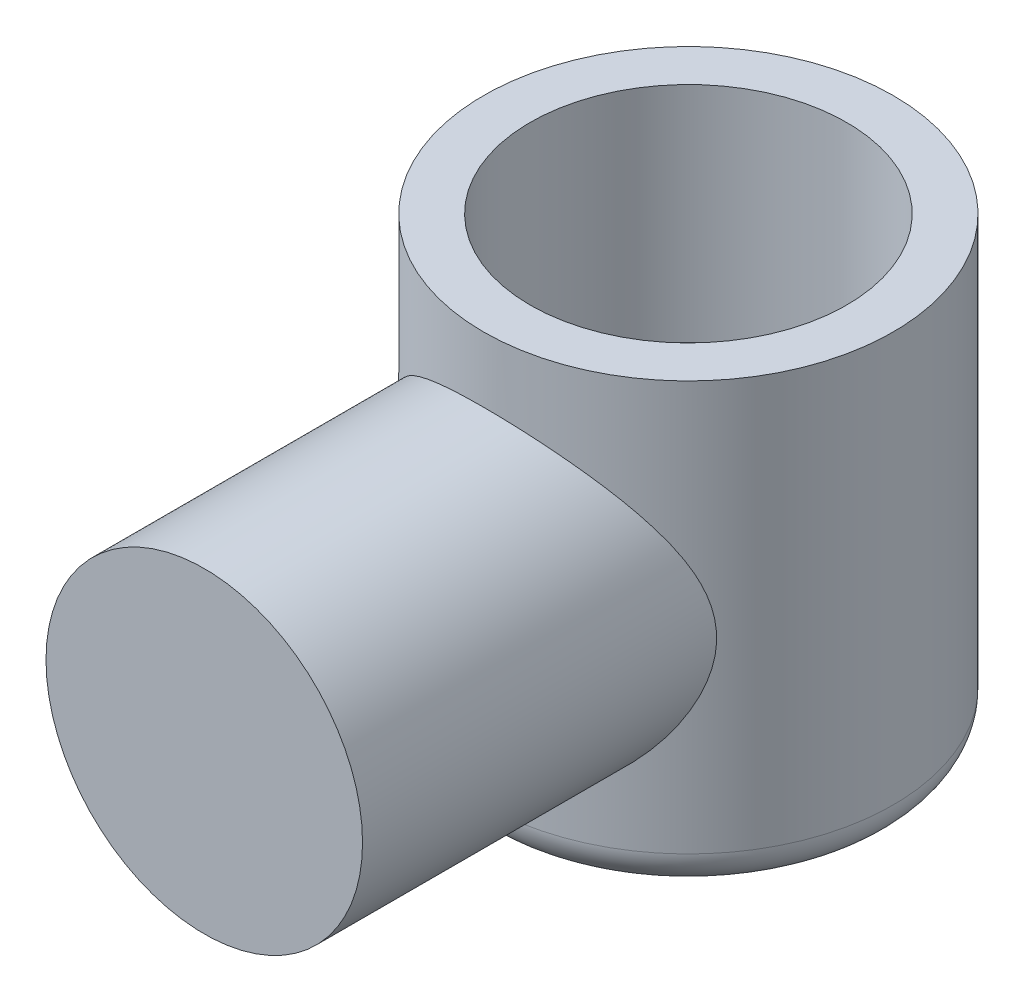
ISO-10303-21;
HEADER;
FILE_DESCRIPTION(('STEP AP214'),'2;1');
FILE_NAME('part.step','',(''),(''),'','','');
FILE_SCHEMA(('AUTOMOTIVE_DESIGN { 1 0 10303 214 1 1 1 1 }'));
ENDSEC;
DATA;
#1=APPLICATION_CONTEXT('core data for automotive mechanical design processes');
#2=APPLICATION_PROTOCOL_DEFINITION('international standard','automotive_design',2000,#1);
#3=PRODUCT_CONTEXT('',#1,'mechanical');
#4=PRODUCT('Part','Part','',(#3));
#5=PRODUCT_RELATED_PRODUCT_CATEGORY('part','',(#4));
#6=PRODUCT_DEFINITION_FORMATION('','',#4);
#7=PRODUCT_DEFINITION_CONTEXT('part definition',#1,'design');
#8=PRODUCT_DEFINITION('design','',#6,#7);
#9=PRODUCT_DEFINITION_SHAPE('','',#8);
#10=(LENGTH_UNIT() NAMED_UNIT(*) SI_UNIT(.MILLI.,.METRE.));
#11=(NAMED_UNIT(*) PLANE_ANGLE_UNIT() SI_UNIT($,.RADIAN.));
#12=(NAMED_UNIT(*) SI_UNIT($,.STERADIAN.) SOLID_ANGLE_UNIT());
#13=UNCERTAINTY_MEASURE_WITH_UNIT(LENGTH_MEASURE(1.E-05),#10,'distance_accuracy_value','');
#14=(GEOMETRIC_REPRESENTATION_CONTEXT(3) GLOBAL_UNCERTAINTY_ASSIGNED_CONTEXT((#13)) GLOBAL_UNIT_ASSIGNED_CONTEXT((#10,
#11,#12)) REPRESENTATION_CONTEXT('',''));
#15=CARTESIAN_POINT('',(0.,0.,0.));
#16=DIRECTION('',(0.,0.,1.));
#17=DIRECTION('',(1.,0.,0.));
#18=AXIS2_PLACEMENT_3D('',#15,#16,#17);
#19=CARTESIAN_POINT('',(0.,60.,0.));
#20=DIRECTION('',(0.,-1.,0.));
#21=DIRECTION('',(0.,0.,-1.));
#22=AXIS2_PLACEMENT_3D('',#19,#20,#21);
#23=CYLINDRICAL_SURFACE('',#22,55.);
#24=CARTESIAN_POINT('',(0.,-50.,0.));
#25=DIRECTION('',(0.,1.,0.));
#26=DIRECTION('',(0.,0.,1.));
#27=AXIS2_PLACEMENT_3D('',#24,#25,#26);
#28=CIRCLE('',#27,55.);
#29=CARTESIAN_POINT('',(0.,-50.,55.));
#30=VERTEX_POINT('',#29);
#31=EDGE_CURVE('E48',#30,#30,#28,.T.);
#32=ORIENTED_EDGE('',*,*,#31,.T.);
#33=EDGE_LOOP('',(#32));
#34=FACE_BOUND('',#33,.T.);
#35=CARTESIAN_POINT('',(0.,60.,0.));
#36=DIRECTION('',(0.,1.,0.));
#37=DIRECTION('',(0.,0.,1.));
#38=AXIS2_PLACEMENT_3D('',#35,#36,#37);
#39=CIRCLE('',#38,55.);
#40=CARTESIAN_POINT('',(0.,60.,55.));
#41=VERTEX_POINT('',#40);
#42=EDGE_CURVE('E63',#41,#41,#39,.T.);
#43=ORIENTED_EDGE('',*,*,#42,.F.);
#44=EDGE_LOOP('',(#43));
#45=FACE_BOUND('',#44,.T.);
#46=CARTESIAN_POINT('',(-42.5,0.,34.9106001094223));
#47=CARTESIAN_POINT('',(-42.5000002288912,-0.489144984326431,34.9105997851785));
#48=CARTESIAN_POINT('',(-42.4915493792357,-0.97829393035291,34.9208955316221));
#49=CARTESIAN_POINT('',(-42.457817106543,-1.95515688155256,34.9619001599965));
#50=CARTESIAN_POINT('',(-42.4325352422677,-2.44287084876996,34.9926095770876));
#51=CARTESIAN_POINT('',(-42.3653387466732,-3.4155049460207,35.0739342720024));
#52=CARTESIAN_POINT('',(-42.3234234950536,-3.9004249711767,35.1245502921923));
#53=CARTESIAN_POINT('',(-42.2232851714191,-4.86621941100944,35.2448610571616));
#54=CARTESIAN_POINT('',(-42.1650596238841,-5.34709320014168,35.3145586980467));
#55=CARTESIAN_POINT('',(-41.9660754884727,-6.78497820199616,35.5512536730363));
#56=CARTESIAN_POINT('',(-41.8012124811986,-7.73435800642852,35.7456011158555));
#57=CARTESIAN_POINT('',(-41.4113987075601,-9.60523078809301,36.1964682107257));
#58=CARTESIAN_POINT('',(-41.1864383853928,-10.526719304493,36.4529977494698));
#59=CARTESIAN_POINT('',(-40.625839626523,-12.5339047626655,37.077660706149));
#60=CARTESIAN_POINT('',(-40.2767899053382,-13.6120680336423,37.4579319519364));
#61=CARTESIAN_POINT('',(-39.502312406044,-15.7187150287624,38.2737974254088));
#62=CARTESIAN_POINT('',(-39.0768618191511,-16.7471838003834,38.7094081628024));
#63=CARTESIAN_POINT('',(-38.1541475858732,-18.7545230170705,39.6192021057817));
#64=CARTESIAN_POINT('',(-37.6568262209241,-19.7333527358697,40.0934161782856));
#65=CARTESIAN_POINT('',(-36.5940886947428,-21.6405718331285,41.0656968927172));
#66=CARTESIAN_POINT('',(-36.0286789558901,-22.5689659569154,41.5637612823181));
#67=CARTESIAN_POINT('',(-34.8161911063449,-24.3991636008042,42.5849452621606));
#68=CARTESIAN_POINT('',(-34.1673571583866,-25.2996270102166,43.1083793188185));
#69=CARTESIAN_POINT('',(-32.8017071071619,-27.0467618949143,44.1564155957314));
#70=CARTESIAN_POINT('',(-32.0848884748354,-27.8934313670834,44.6810178587349));
#71=CARTESIAN_POINT('',(-30.5847654803963,-29.5305572948476,45.7209427029055));
#72=CARTESIAN_POINT('',(-29.8015066541491,-30.3210515789884,46.2362713509327));
#73=CARTESIAN_POINT('',(-28.1689583325873,-31.8434494585851,47.2486214887345));
#74=CARTESIAN_POINT('',(-27.3196727402466,-32.575356512066,47.7456440580623));
#75=CARTESIAN_POINT('',(-25.5947411738821,-33.945822343589,48.6912095230291));
#76=CARTESIAN_POINT('',(-24.72187161527,-34.5870634828419,49.1409219510165));
#77=CARTESIAN_POINT('',(-22.9182735623926,-35.8076562583811,50.007535260636));
#78=CARTESIAN_POINT('',(-21.9875441987151,-36.3870069643344,50.4244356490151));
#79=CARTESIAN_POINT('',(-20.0714287908287,-37.4780239485196,51.217301799851));
#80=CARTESIAN_POINT('',(-19.0860806014535,-37.9897362927696,51.5932953912362));
#81=CARTESIAN_POINT('',(-17.0640681321183,-38.9398857441942,52.2968713559347));
#82=CARTESIAN_POINT('',(-16.0274125252987,-39.3783351814569,52.6244618743697));
#83=CARTESIAN_POINT('',(-14.0689559091465,-40.1152994850695,53.1783562571218));
#84=CARTESIAN_POINT('',(-13.1535489443157,-40.4249510711338,53.4124861195881));
#85=CARTESIAN_POINT('',(-11.2942726185532,-40.9833041668282,53.8363088428573));
#86=CARTESIAN_POINT('',(-10.3504059701077,-41.2320114645527,54.026005923523));
#87=CARTESIAN_POINT('',(-8.44015207584701,-41.665002526401,54.3571797125297));
#88=CARTESIAN_POINT('',(-7.47377617658784,-41.8493180305475,54.4986801770982));
#89=CARTESIAN_POINT('',(-5.5245108686448,-42.1509470517049,54.730640675359));
#90=CARTESIAN_POINT('',(-4.54162127314463,-42.2682598102003,54.8211001312332));
#91=CARTESIAN_POINT('',(-2.5636885701714,-42.4342465292041,54.9491808198944));
#92=CARTESIAN_POINT('',(-1.56861822921809,-42.4827177009214,54.9866459443309));
#93=CARTESIAN_POINT('',(0.423039341332994,-42.5095622367977,55.0073886621494));
#94=CARTESIAN_POINT('',(1.41962657400649,-42.4879354586325,54.9906661455108));
#95=CARTESIAN_POINT('',(3.40656238673648,-42.3749415857676,54.9034096745232));
#96=CARTESIAN_POINT('',(4.396910224597,-42.2835663464949,54.8328694358445));
#97=CARTESIAN_POINT('',(6.36370590413459,-42.03255987222,54.6395432558043));
#98=CARTESIAN_POINT('',(7.34015394373414,-41.8729296101235,54.5167580591416));
#99=CARTESIAN_POINT('',(9.2301000257284,-41.4963003951078,54.2280279248772));
#100=CARTESIAN_POINT('',(10.1444857875692,-41.2821084508025,54.0641998867619));
#101=CARTESIAN_POINT('',(11.9490403604779,-40.7963668173438,53.6942155727445));
#102=CARTESIAN_POINT('',(12.8392100607105,-40.5248192373904,53.4880608533747));
#103=CARTESIAN_POINT('',(14.5911042584072,-39.9275135843936,53.0369496202634));
#104=CARTESIAN_POINT('',(15.4528257553072,-39.60174981467,52.791989029187));
#105=CARTESIAN_POINT('',(17.1442933501702,-38.899382827112,52.2671744266677));
#106=CARTESIAN_POINT('',(17.9740375393873,-38.522776580481,51.9873183365002));
#107=CARTESIAN_POINT('',(19.6837958371438,-37.6802190386756,51.3659386528833));
#108=CARTESIAN_POINT('',(20.5600030565746,-37.2090438996185,51.0210269275216));
#109=CARTESIAN_POINT('',(22.2675406540159,-36.2130338409742,50.299264721007));
#110=CARTESIAN_POINT('',(23.0988684038329,-35.6881957840218,49.9224123726884));
#111=CARTESIAN_POINT('',(24.7153332647529,-34.5884156820301,49.1422236946961));
#112=CARTESIAN_POINT('',(25.5004441782203,-34.0134456696103,48.7388726133643));
#113=CARTESIAN_POINT('',(27.0228293792587,-32.8169795483925,47.9115579848606));
#114=CARTESIAN_POINT('',(27.7601014001569,-32.19548123802,47.487593462658));
#115=CARTESIAN_POINT('',(29.3304821825735,-30.7783477350251,46.5373693848213));
#116=CARTESIAN_POINT('',(30.1527706068329,-29.9729330412174,46.0077784030319));
#117=CARTESIAN_POINT('',(31.7262057612385,-28.3022098910415,44.9372175215653));
#118=CARTESIAN_POINT('',(32.477339472655,-27.4368905242271,44.3962455616245));
#119=CARTESIAN_POINT('',(33.9079008374094,-25.6479460113039,43.3135022961492));
#120=CARTESIAN_POINT('',(34.5872699056561,-24.7242741971617,42.7717306980876));
#121=CARTESIAN_POINT('',(35.8719733800113,-22.8203893907003,41.7001287343741));
#122=CARTESIAN_POINT('',(36.4773210862751,-21.8401866025813,41.170296237502));
#123=CARTESIAN_POINT('',(37.517968655817,-19.9896300508913,40.2220436202053));
#124=CARTESIAN_POINT('',(37.9648492101727,-19.1278128186682,39.7996579049517));
#125=CARTESIAN_POINT('',(38.8030403799898,-17.3645305959695,38.9828980831988));
#126=CARTESIAN_POINT('',(39.1943491287326,-16.4630642749686,38.5885249178945));
#127=CARTESIAN_POINT('',(39.9175389259675,-14.622449580056,37.839932930076));
#128=CARTESIAN_POINT('',(40.2495261990121,-13.6833723232868,37.485642758672));
#129=CARTESIAN_POINT('',(40.8507404541482,-11.7674970009388,36.8295424232635));
#130=CARTESIAN_POINT('',(41.119988256823,-10.7907115749055,36.5277148576057));
#131=CARTESIAN_POINT('',(41.5345815990419,-9.04061648798712,36.054853975055));
#132=CARTESIAN_POINT('',(41.6941603323236,-8.27445695288277,35.8698008029623));
#133=CARTESIAN_POINT('',(41.9718928045791,-6.72526146381532,35.544424338069));
#134=CARTESIAN_POINT('',(42.0900521372401,-5.94222780387469,35.4040950055495));
#135=CARTESIAN_POINT('',(42.2827511759414,-4.36456911454337,35.1737348044515));
#136=CARTESIAN_POINT('',(42.3573534812163,-3.56996241065758,35.0836317601953));
#137=CARTESIAN_POINT('',(42.4616901072443,-1.97348820605074,34.9572837445148));
#138=CARTESIAN_POINT('',(42.4914246243284,-1.17162073711655,34.9210385374211));
#139=CARTESIAN_POINT('',(42.5053850426105,0.435176174921321,34.9040453977496));
#140=CARTESIAN_POINT('',(42.4894934910472,1.24010818406592,34.9234406974643));
#141=CARTESIAN_POINT('',(42.4123072502091,2.84452532357316,35.0171357291868));
#142=CARTESIAN_POINT('',(42.3510126231658,3.6440104614,35.0914353859403));
#143=CARTESIAN_POINT('',(42.1842029453717,5.23277556096705,35.2917822760301));
#144=CARTESIAN_POINT('',(42.0786310171087,6.02204104565626,35.4178960642378));
#145=CARTESIAN_POINT('',(41.8252151915092,7.58474371443984,35.7167972394694));
#146=CARTESIAN_POINT('',(41.6773650038227,8.35817852481185,35.8895915716235));
#147=CARTESIAN_POINT('',(41.2864540274045,10.1369737314797,36.3392929742949));
#148=CARTESIAN_POINT('',(41.0280714692369,11.135049070886,36.6317541295531));
#149=CARTESIAN_POINT('',(40.4458536693613,13.0930239692896,37.2735875059239));
#150=CARTESIAN_POINT('',(40.121994696536,14.0529095354823,37.6229803522897));
#151=CARTESIAN_POINT('',(39.4124859714239,15.9348611614238,38.3656134386276));
#152=CARTESIAN_POINT('',(39.0266847690216,16.8568273830053,38.758960411771));
#153=CARTESIAN_POINT('',(38.1973396307715,18.6600707856832,39.5765363675372));
#154=CARTESIAN_POINT('',(37.7537950933454,19.5413475427413,40.0007656718762));
#155=CARTESIAN_POINT('',(36.9662771061941,20.9804343859473,40.7268929652843));
#156=CARTESIAN_POINT('',(36.6374349767591,21.5494339692057,41.0232163817058));
#157=CARTESIAN_POINT('',(35.9553766684857,22.6691559838573,41.6223140325529));
#158=CARTESIAN_POINT('',(35.6021589373846,23.2198772479557,41.9250886769489));
#159=CARTESIAN_POINT('',(34.5064155517986,24.8448219464773,42.8393677482624));
#160=CARTESIAN_POINT('',(33.7278464736521,25.8917410569612,43.4567835402315));
#161=CARTESIAN_POINT('',(32.0777539257044,27.9099592557178,44.6886812058769));
#162=CARTESIAN_POINT('',(31.2062807938561,28.8812988064526,45.303164481789));
#163=CARTESIAN_POINT('',(29.3714911273788,30.7453189878156,46.5136833701093));
#164=CARTESIAN_POINT('',(28.4082010753147,31.6380221572932,47.1097242365181));
#165=CARTESIAN_POINT('',(26.5620447442271,33.1950093306779,48.1704448481396));
#166=CARTESIAN_POINT('',(25.6931559813475,33.8723827186685,48.6402848971226));
#167=CARTESIAN_POINT('',(23.8943556587282,35.1644095689693,49.5487098496071));
#168=CARTESIAN_POINT('',(22.9644462466236,35.7790652367004,49.9872958519696));
#169=CARTESIAN_POINT('',(21.0471403281283,36.9394348124103,50.8243118571386));
#170=CARTESIAN_POINT('',(20.0598193654954,37.4852364501289,51.2227928257231));
#171=CARTESIAN_POINT('',(18.0302370523761,38.5025757457105,51.9719144140954));
#172=CARTESIAN_POINT('',(16.9879849733342,38.9741258827359,52.3225630715474));
#173=CARTESIAN_POINT('',(15.0260992001812,39.7667961530003,52.9158834491261));
#174=CARTESIAN_POINT('',(14.1138078102259,40.0999119714526,53.1668486930162));
#175=CARTESIAN_POINT('',(12.2585593585735,40.7053988068652,53.6249967353162));
#176=CARTESIAN_POINT('',(11.3156054482692,40.9777760438686,53.8321840167727));
#177=CARTESIAN_POINT('',(9.40464298303717,41.4580857223377,54.1986972401111));
#178=CARTESIAN_POINT('',(8.43664406159892,41.6660425550706,54.3580412959979));
#179=CARTESIAN_POINT('',(6.48156234335324,42.0145831456137,54.6256598599936));
#180=CARTESIAN_POINT('',(5.49447931403791,42.1551660820471,54.7339337454892));
#181=CARTESIAN_POINT('',(3.50502362873862,42.3670733476336,54.8973070486375));
#182=CARTESIAN_POINT('',(2.50260987888922,42.4381562865927,54.9522211308231));
#183=CARTESIAN_POINT('',(0.493748792290032,42.5090145592549,55.0069614539599));
#184=CARTESIAN_POINT('',(-0.512698551775262,42.5087897635725,55.0067875949558));
#185=CARTESIAN_POINT('',(-2.52154087716591,42.437036450201,54.9513562197786));
#186=CARTESIAN_POINT('',(-3.52393572265735,42.3655055620068,54.8960968723393));
#187=CARTESIAN_POINT('',(-5.51673467352636,42.1523403569969,54.7317566995921));
#188=CARTESIAN_POINT('',(-6.50713905470987,42.0107076558211,54.6226771146821));
#189=CARTESIAN_POINT('',(-8.41563515634284,41.6691207400988,54.3604116543332));
#190=CARTESIAN_POINT('',(-9.33474270210216,41.4727310942901,54.2099272693806));
#191=CARTESIAN_POINT('',(-11.1502643764458,41.0219019735116,53.8658076806591));
#192=CARTESIAN_POINT('',(-12.0466795113652,40.7674650777775,53.6721743941507));
#193=CARTESIAN_POINT('',(-13.8123596026901,40.2035797235384,53.2451305484176));
#194=CARTESIAN_POINT('',(-14.6816214397027,39.8941249716639,53.0117154387657));
#195=CARTESIAN_POINT('',(-16.3892176622093,39.2235276573297,52.5089126749995));
#196=CARTESIAN_POINT('',(-17.227550219405,38.8623820454462,52.239522898677));
#197=CARTESIAN_POINT('',(-18.947506309198,38.0555777278059,51.6420054665057));
#198=CARTESIAN_POINT('',(-19.8258088341394,37.6051683773719,51.3107379993337));
#199=CARTESIAN_POINT('',(-21.5391589454668,36.6507367118262,50.6154089925646));
#200=CARTESIAN_POINT('',(-22.3742043001149,36.1467116346429,50.2513457636067));
#201=CARTESIAN_POINT('',(-23.999509199662,35.0886636820461,49.4957278598706));
#202=CARTESIAN_POINT('',(-24.7897473161003,34.5346172074762,49.1041602285745));
#203=CARTESIAN_POINT('',(-26.3237569293407,33.3801064079904,48.2991748466065));
#204=CARTESIAN_POINT('',(-27.0675261098221,32.7796397725178,47.8857560086183));
#205=CARTESIAN_POINT('',(-28.6509573580584,31.4113753866856,46.9587378664033));
#206=CARTESIAN_POINT('',(-29.4802989453421,30.6340396428969,46.4415581106478));
#207=CARTESIAN_POINT('',(-31.0701027091918,29.0203722609394,45.3933418977294));
#208=CARTESIAN_POINT('',(-31.8305534878249,28.1840309009036,44.862303166262));
#209=CARTESIAN_POINT('',(-33.2821953978982,26.4541419610358,43.7961985858952));
#210=CARTESIAN_POINT('',(-33.9733248062038,25.5605445407598,43.2611295962358));
#211=CARTESIAN_POINT('',(-35.2842083300915,23.7181943220513,42.198768040696));
#212=CARTESIAN_POINT('',(-35.9039717019361,22.7694487004824,41.6714744740866));
#213=CARTESIAN_POINT('',(-37.0001203060926,20.9342354675197,40.6996494906342));
#214=CARTESIAN_POINT('',(-37.4847864890803,20.0539512809718,40.2527782799644));
#215=CARTESIAN_POINT('',(-38.3951051836026,18.2506442627443,39.3854163248201));
#216=CARTESIAN_POINT('',(-38.8207553017178,17.3276196997361,38.9649266506376));
#217=CARTESIAN_POINT('',(-39.6093170099397,15.4401046464797,38.1630433572948));
#218=CARTESIAN_POINT('',(-39.9723051910933,14.4756666030004,37.7816022450413));
#219=CARTESIAN_POINT('',(-40.6317973431999,12.5054129724264,37.0714448177416));
#220=CARTESIAN_POINT('',(-40.9283192071307,11.4996086077943,36.7427143196034));
#221=CARTESIAN_POINT('',(-41.4014899159747,9.63899637832375,36.2080066033364));
#222=CARTESIAN_POINT('',(-41.5901609644238,8.79055299382778,35.9905715704425));
#223=CARTESIAN_POINT('',(-41.9166090800101,7.07196120855194,35.6098429311225));
#224=CARTESIAN_POINT('',(-42.0543943038685,6.20181631029909,35.4465406479408));
#225=CARTESIAN_POINT('',(-42.2758893719668,4.44728055097972,35.1820884825305));
#226=CARTESIAN_POINT('',(-42.3597332447172,3.56293063917701,35.0807845832094));
#227=CARTESIAN_POINT('',(-42.4437872790948,2.23016334273371,34.9789438049603));
#228=CARTESIAN_POINT('',(-42.4648533658333,1.78477990634345,34.953349289984));
#229=CARTESIAN_POINT('',(-42.4929588646263,0.892931998867727,34.9191785088844));
#230=CARTESIAN_POINT('',(-42.4999997910793,0.446467649709082,34.9106004053762));
#231=CARTESIAN_POINT('',(-42.5,0.,34.9106001094223));
#232=B_SPLINE_CURVE_WITH_KNOTS('',3,(#46,#47,#48,#49,#50,#51,#52,#53,#54,#55,#56,#57,#58,#59,
#60,#61,#62,#63,#64,#65,#66,#67,#68,#69,#70,#71,#72,#73,#74,#75,#76,#77,#78,#79,#80,#81,#82,#83,
#84,#85,#86,#87,#88,#89,#90,#91,#92,#93,#94,#95,#96,#97,#98,#99,#100,#101,#102,#103,#104,#105,
#106,#107,#108,#109,#110,#111,#112,#113,#114,#115,#116,#117,#118,#119,#120,#121,#122,#123,#124,
#125,#126,#127,#128,#129,#130,#131,#132,#133,#134,#135,#136,#137,#138,#139,#140,#141,#142,#143,
#144,#145,#146,#147,#148,#149,#150,#151,#152,#153,#154,#155,#156,#157,#158,#159,#160,#161,#162,
#163,#164,#165,#166,#167,#168,#169,#170,#171,#172,#173,#174,#175,#176,#177,#178,#179,#180,#181,
#182,#183,#184,#185,#186,#187,#188,#189,#190,#191,#192,#193,#194,#195,#196,#197,#198,#199,#200,
#201,#202,#203,#204,#205,#206,#207,#208,#209,#210,#211,#212,#213,#214,#215,#216,#217,#218,#219,
#220,#221,#222,#223,#224,#225,#226,#227,#228,#229,#230,#231),.UNSPECIFIED.,.T.,.F.,(4,2,2,2,2,2,
2,2,2,2,2,2,2,2,2,2,2,2,2,2,2,2,2,2,2,2,2,2,2,2,2,2,2,2,2,2,2,2,2,2,2,2,2,2,2,2,2,2,2,2,2,2,2,2,
2,2,2,2,2,2,2,2,2,2,2,2,2,2,2,2,2,2,2,2,2,2,2,2,2,2,2,2,2,2,2,2,2,2,2,2,2,2,4),(0.,
1.46726072876535,2.93455992442403,4.40191384447283,5.86949059518675,8.81334224057232,
11.7576622534266,15.338077768014,18.9195639655034,22.5039425623606,26.0879833301006,
29.7662186314789,33.4445908185378,37.1204620335439,40.7961161254391,44.3110493456528,
47.8260353946814,51.3386150428796,54.8506029300266,57.8305081307339,60.8101302095211,
63.7882814929021,66.7664664902562,69.7534063514732,72.7403522772671,75.7276470440363,
78.7148992313838,81.5718115660531,84.4286188587187,87.2857265156149,90.1430044517773,
93.2988466244722,96.4548734068978,99.612672264151,102.770620633176,106.567968132271,
110.366009071618,114.167126963974,117.967560864886,121.141357504549,124.315260730355,
127.483422343717,130.650531075769,133.060870695186,135.470884672879,137.877426449219,
140.283957695063,142.696689496426,145.109417990802,147.525255354812,149.941452345179,
153.15145332436,156.362619821126,159.581760727151,162.800935173331,164.963004708631,
167.125212053947,171.449945565368,175.772347614526,180.093506713136,183.683393120231,
187.273153248174,190.858292300084,194.442828166945,197.449117017713,200.45509786256,
203.459939168593,206.464817106685,209.480095020533,212.495378405501,215.510762034122,
218.526076170282,221.378472990296,224.230743093346,227.083339671349,229.936104603371,
233.056601057513,236.177258345305,239.29939567177,242.421688502347,246.164523700657,
249.907977021617,253.654734430697,257.40100533207,260.697840397646,263.994809128556,
267.287719027346,270.57974139517,273.264602494529,275.949033038248,278.626767528987,
279.966156086105,281.305400011879),.UNSPECIFIED.);
#233=CARTESIAN_POINT('',(-42.5,0.,34.9106001094223));
#234=VERTEX_POINT('',#233);
#235=EDGE_CURVE('E53',#234,#234,#232,.T.);
#236=ORIENTED_EDGE('',*,*,#235,.F.);
#237=EDGE_LOOP('',(#236));
#238=FACE_BOUND('',#237,.T.);
#239=ADVANCED_FACE('F39',(#34,#45,#238),#23,.T.);
#240=CARTESIAN_POINT('',(0.,60.,0.));
#241=DIRECTION('',(0.,1.,0.));
#242=DIRECTION('',(0.,0.,1.));
#243=AXIS2_PLACEMENT_3D('',#240,#241,#242);
#244=PLANE('',#243);
#245=CARTESIAN_POINT('',(0.,60.,0.));
#246=DIRECTION('',(0.,1.,0.));
#247=DIRECTION('',(0.,0.,1.));
#248=AXIS2_PLACEMENT_3D('',#245,#246,#247);
#249=CIRCLE('',#248,42.5);
#250=CARTESIAN_POINT('',(0.,60.,42.5));
#251=VERTEX_POINT('',#250);
#252=EDGE_CURVE('E43',#251,#251,#249,.F.);
#253=ORIENTED_EDGE('',*,*,#252,.T.);
#254=EDGE_LOOP('',(#253));
#255=FACE_BOUND('',#254,.T.);
#256=ORIENTED_EDGE('',*,*,#42,.T.);
#257=EDGE_LOOP('',(#256));
#258=FACE_BOUND('',#257,.T.);
#259=ADVANCED_FACE('F76',(#255,#258),#244,.T.);
#260=CARTESIAN_POINT('',(0.,-60.,0.));
#261=DIRECTION('',(0.,1.,0.));
#262=DIRECTION('',(0.,0.,1.));
#263=AXIS2_PLACEMENT_3D('',#260,#261,#262);
#264=PLANE('',#263);
#265=CARTESIAN_POINT('',(0.,-60.,0.));
#266=DIRECTION('',(0.,1.,0.));
#267=DIRECTION('',(0.,0.,1.));
#268=AXIS2_PLACEMENT_3D('',#265,#266,#267);
#269=CIRCLE('',#268,45.);
#270=CARTESIAN_POINT('',(0.,-60.,45.));
#271=VERTEX_POINT('',#270);
#272=EDGE_CURVE('E10',#271,#271,#269,.F.);
#273=ORIENTED_EDGE('',*,*,#272,.T.);
#274=EDGE_LOOP('',(#273));
#275=FACE_BOUND('',#274,.T.);
#276=ADVANCED_FACE('F73',(#275),#264,.F.);
#277=CARTESIAN_POINT('',(0.,0.,130.));
#278=DIRECTION('',(0.,0.,-1.));
#279=DIRECTION('',(-1.,0.,0.));
#280=AXIS2_PLACEMENT_3D('',#277,#278,#279);
#281=CYLINDRICAL_SURFACE('',#280,42.5);
#282=CARTESIAN_POINT('',(0.,0.,130.));
#283=DIRECTION('',(0.,0.,1.));
#284=DIRECTION('',(1.,0.,0.));
#285=AXIS2_PLACEMENT_3D('',#282,#283,#284);
#286=CIRCLE('',#285,42.5);
#287=CARTESIAN_POINT('',(42.5,0.,130.));
#288=VERTEX_POINT('',#287);
#289=EDGE_CURVE('E95',#288,#288,#286,.T.);
#290=ORIENTED_EDGE('',*,*,#289,.F.);
#291=EDGE_LOOP('',(#290));
#292=FACE_BOUND('',#291,.T.);
#293=ORIENTED_EDGE('',*,*,#235,.T.);
#294=EDGE_LOOP('',(#293));
#295=FACE_BOUND('',#294,.T.);
#296=ADVANCED_FACE('F67',(#292,#295),#281,.T.);
#297=CARTESIAN_POINT('',(0.,0.,130.));
#298=DIRECTION('',(0.,0.,1.));
#299=DIRECTION('',(1.,0.,0.));
#300=AXIS2_PLACEMENT_3D('',#297,#298,#299);
#301=PLANE('',#300);
#302=ORIENTED_EDGE('',*,*,#289,.T.);
#303=EDGE_LOOP('',(#302));
#304=FACE_BOUND('',#303,.T.);
#305=ADVANCED_FACE('F72',(#304),#301,.T.);
#306=CARTESIAN_POINT('',(0.,-50.,0.));
#307=DIRECTION('',(0.,1.,0.));
#308=DIRECTION('',(0.,0.,1.));
#309=AXIS2_PLACEMENT_3D('',#306,#307,#308);
#310=TOROIDAL_SURFACE('',#309,45.,10.);
#311=ORIENTED_EDGE('',*,*,#272,.F.);
#312=EDGE_LOOP('',(#311));
#313=FACE_BOUND('',#312,.T.);
#314=ORIENTED_EDGE('',*,*,#31,.F.);
#315=EDGE_LOOP('',(#314));
#316=FACE_BOUND('',#315,.T.);
#317=ADVANCED_FACE('F41',(#313,#316),#310,.T.);
#318=CARTESIAN_POINT('',(0.,110.,0.));
#319=DIRECTION('',(0.,-1.,0.));
#320=DIRECTION('',(0.,0.,-1.));
#321=AXIS2_PLACEMENT_3D('',#318,#319,#320);
#322=CYLINDRICAL_SURFACE('',#321,42.5);
#323=ORIENTED_EDGE('',*,*,#252,.F.);
#324=EDGE_LOOP('',(#323));
#325=FACE_BOUND('',#324,.T.);
#326=CARTESIAN_POINT('',(0.,0.,0.));
#327=DIRECTION('',(0.,1.,0.));
#328=DIRECTION('',(0.,0.,1.));
#329=AXIS2_PLACEMENT_3D('',#326,#327,#328);
#330=CIRCLE('',#329,42.5);
#331=CARTESIAN_POINT('',(0.,0.,42.5));
#332=VERTEX_POINT('',#331);
#333=EDGE_CURVE('E102',#332,#332,#330,.T.);
#334=ORIENTED_EDGE('',*,*,#333,.F.);
#335=EDGE_LOOP('',(#334));
#336=FACE_BOUND('',#335,.T.);
#337=ADVANCED_FACE('F110',(#325,#336),#322,.F.);
#338=CARTESIAN_POINT('',(0.,0.,0.));
#339=DIRECTION('',(0.,1.,0.));
#340=DIRECTION('',(0.,0.,1.));
#341=AXIS2_PLACEMENT_3D('',#338,#339,#340);
#342=PLANE('',#341);
#343=ORIENTED_EDGE('',*,*,#333,.T.);
#344=EDGE_LOOP('',(#343));
#345=FACE_BOUND('',#344,.T.);
#346=ADVANCED_FACE('F108',(#345),#342,.T.);
#347=CLOSED_SHELL('',(#239,#259,#276,#296,#305,#317,#337,#346));
#348=MANIFOLD_SOLID_BREP('B2',#347);
#349=ADVANCED_BREP_SHAPE_REPRESENTATION('',(#18,#348),#14);
#350=SHAPE_DEFINITION_REPRESENTATION(#9,#349);
ENDSEC;
END-ISO-10303-21;
